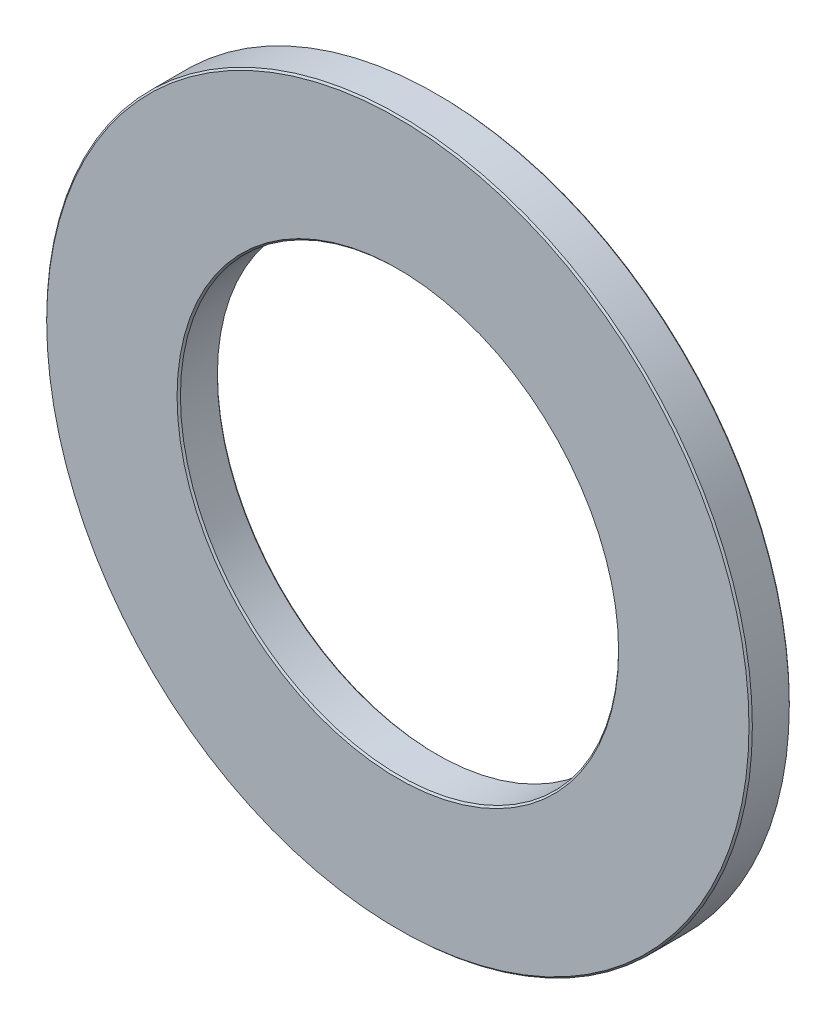
ISO-10303-21;
HEADER;
FILE_DESCRIPTION(('STEP AP214'),'2;1');
FILE_NAME('part.step','',(''),(''),'','','');
FILE_SCHEMA(('AUTOMOTIVE_DESIGN { 1 0 10303 214 1 1 1 1 }'));
ENDSEC;
DATA;
#1=APPLICATION_CONTEXT('core data for automotive mechanical design processes');
#2=APPLICATION_PROTOCOL_DEFINITION('international standard','automotive_design',2000,#1);
#3=PRODUCT_CONTEXT('',#1,'mechanical');
#4=PRODUCT('Part','Part','',(#3));
#5=PRODUCT_RELATED_PRODUCT_CATEGORY('part','',(#4));
#6=PRODUCT_DEFINITION_FORMATION('','',#4);
#7=PRODUCT_DEFINITION_CONTEXT('part definition',#1,'design');
#8=PRODUCT_DEFINITION('design','',#6,#7);
#9=PRODUCT_DEFINITION_SHAPE('','',#8);
#10=(LENGTH_UNIT() NAMED_UNIT(*) SI_UNIT(.MILLI.,.METRE.));
#11=(NAMED_UNIT(*) PLANE_ANGLE_UNIT() SI_UNIT($,.RADIAN.));
#12=(NAMED_UNIT(*) SI_UNIT($,.STERADIAN.) SOLID_ANGLE_UNIT());
#13=UNCERTAINTY_MEASURE_WITH_UNIT(LENGTH_MEASURE(1.E-05),#10,'distance_accuracy_value','');
#14=(GEOMETRIC_REPRESENTATION_CONTEXT(3) GLOBAL_UNCERTAINTY_ASSIGNED_CONTEXT((#13)) GLOBAL_UNIT_ASSIGNED_CONTEXT((#10,
#11,#12)) REPRESENTATION_CONTEXT('',''));
#15=CARTESIAN_POINT('',(0.,0.,0.));
#16=DIRECTION('',(0.,0.,1.));
#17=DIRECTION('',(1.,0.,0.));
#18=AXIS2_PLACEMENT_3D('',#15,#16,#17);
#19=CARTESIAN_POINT('',(0.,0.,6.));
#20=DIRECTION('',(0.,0.,1.));
#21=DIRECTION('',(1.,0.,0.));
#22=AXIS2_PLACEMENT_3D('',#19,#20,#21);
#23=PLANE('',#22);
#24=CARTESIAN_POINT('',(0.,0.,6.));
#25=DIRECTION('',(0.,0.,1.));
#26=DIRECTION('',(1.,0.,0.));
#27=AXIS2_PLACEMENT_3D('',#24,#25,#26);
#28=CIRCLE('',#27,32.85);
#29=CARTESIAN_POINT('',(32.85,0.,6.));
#30=VERTEX_POINT('',#29);
#31=EDGE_CURVE('E48',#30,#30,#28,.F.);
#32=ORIENTED_EDGE('',*,*,#31,.T.);
#33=EDGE_LOOP('',(#32));
#34=FACE_BOUND('',#33,.T.);
#35=CARTESIAN_POINT('',(0.,0.,6.));
#36=DIRECTION('',(0.,0.,1.));
#37=DIRECTION('',(1.,0.,0.));
#38=AXIS2_PLACEMENT_3D('',#35,#36,#37);
#39=CIRCLE('',#38,52.25);
#40=CARTESIAN_POINT('',(52.25,0.,6.));
#41=VERTEX_POINT('',#40);
#42=EDGE_CURVE('E52',#41,#41,#39,.T.);
#43=ORIENTED_EDGE('',*,*,#42,.T.);
#44=EDGE_LOOP('',(#43));
#45=FACE_BOUND('',#44,.T.);
#46=ADVANCED_FACE('F36',(#34,#45),#23,.T.);
#47=CARTESIAN_POINT('',(0.,0.,0.));
#48=DIRECTION('',(0.,0.,1.));
#49=DIRECTION('',(1.,0.,0.));
#50=AXIS2_PLACEMENT_3D('',#47,#48,#49);
#51=PLANE('',#50);
#52=CARTESIAN_POINT('',(0.,0.,0.));
#53=DIRECTION('',(0.,0.,1.));
#54=DIRECTION('',(1.,0.,0.));
#55=AXIS2_PLACEMENT_3D('',#52,#53,#54);
#56=CIRCLE('',#55,32.85);
#57=CARTESIAN_POINT('',(32.85,0.,0.));
#58=VERTEX_POINT('',#57);
#59=EDGE_CURVE('E63',#58,#58,#56,.T.);
#60=ORIENTED_EDGE('',*,*,#59,.T.);
#61=EDGE_LOOP('',(#60));
#62=FACE_BOUND('',#61,.T.);
#63=CARTESIAN_POINT('',(0.,0.,0.));
#64=DIRECTION('',(0.,0.,1.));
#65=DIRECTION('',(1.,0.,0.));
#66=AXIS2_PLACEMENT_3D('',#63,#64,#65);
#67=CIRCLE('',#66,52.25);
#68=CARTESIAN_POINT('',(52.25,0.,0.));
#69=VERTEX_POINT('',#68);
#70=EDGE_CURVE('E66',#69,#69,#67,.F.);
#71=ORIENTED_EDGE('',*,*,#70,.T.);
#72=EDGE_LOOP('',(#71));
#73=FACE_BOUND('',#72,.T.);
#74=ADVANCED_FACE('F70',(#62,#73),#51,.F.);
#75=CARTESIAN_POINT('',(0.,0.,6.));
#76=DIRECTION('',(0.,0.,-1.));
#77=DIRECTION('',(-1.,0.,0.));
#78=AXIS2_PLACEMENT_3D('',#75,#76,#77);
#79=CYLINDRICAL_SURFACE('',#78,52.5);
#80=CARTESIAN_POINT('',(0.,0.,0.249999999999993));
#81=DIRECTION('',(0.,0.,1.));
#82=DIRECTION('',(1.,0.,0.));
#83=AXIS2_PLACEMENT_3D('',#80,#81,#82);
#84=CIRCLE('',#83,52.5);
#85=CARTESIAN_POINT('',(52.5,0.,0.249999999999993));
#86=VERTEX_POINT('',#85);
#87=EDGE_CURVE('E10',#86,#86,#84,.T.);
#88=ORIENTED_EDGE('',*,*,#87,.T.);
#89=EDGE_LOOP('',(#88));
#90=FACE_BOUND('',#89,.T.);
#91=CARTESIAN_POINT('',(0.,0.,5.74999999999999));
#92=DIRECTION('',(0.,0.,1.));
#93=DIRECTION('',(1.,0.,0.));
#94=AXIS2_PLACEMENT_3D('',#91,#92,#93);
#95=CIRCLE('',#94,52.5);
#96=CARTESIAN_POINT('',(52.5,0.,5.74999999999999));
#97=VERTEX_POINT('',#96);
#98=EDGE_CURVE('E44',#97,#97,#95,.F.);
#99=ORIENTED_EDGE('',*,*,#98,.T.);
#100=EDGE_LOOP('',(#99));
#101=FACE_BOUND('',#100,.T.);
#102=ADVANCED_FACE('F91',(#90,#101),#79,.T.);
#103=CARTESIAN_POINT('',(0.,0.,6.));
#104=DIRECTION('',(0.,0.,-1.));
#105=DIRECTION('',(-1.,0.,0.));
#106=AXIS2_PLACEMENT_3D('',#103,#104,#105);
#107=CYLINDRICAL_SURFACE('',#106,32.6);
#108=CARTESIAN_POINT('',(0.,0.,0.250000000000028));
#109=DIRECTION('',(0.,0.,1.));
#110=DIRECTION('',(1.,0.,0.));
#111=AXIS2_PLACEMENT_3D('',#108,#109,#110);
#112=CIRCLE('',#111,32.6);
#113=CARTESIAN_POINT('',(32.6,0.,0.250000000000028));
#114=VERTEX_POINT('',#113);
#115=EDGE_CURVE('E57',#114,#114,#112,.F.);
#116=ORIENTED_EDGE('',*,*,#115,.T.);
#117=EDGE_LOOP('',(#116));
#118=FACE_BOUND('',#117,.T.);
#119=CARTESIAN_POINT('',(0.,0.,5.74999999999998));
#120=DIRECTION('',(0.,0.,1.));
#121=DIRECTION('',(1.,0.,0.));
#122=AXIS2_PLACEMENT_3D('',#119,#120,#121);
#123=CIRCLE('',#122,32.6);
#124=CARTESIAN_POINT('',(32.6,0.,5.74999999999998));
#125=VERTEX_POINT('',#124);
#126=EDGE_CURVE('E60',#125,#125,#123,.T.);
#127=ORIENTED_EDGE('',*,*,#126,.T.);
#128=EDGE_LOOP('',(#127));
#129=FACE_BOUND('',#128,.T.);
#130=ADVANCED_FACE('F96',(#118,#129),#107,.F.);
#131=CARTESIAN_POINT('',(0.,0.,0.));
#132=DIRECTION('',(0.,0.,-1.));
#133=DIRECTION('',(-1.,0.,0.));
#134=AXIS2_PLACEMENT_3D('',#131,#132,#133);
#135=CONICAL_SURFACE('',#134,32.85,0.785398163397448);
#136=ORIENTED_EDGE('',*,*,#115,.F.);
#137=EDGE_LOOP('',(#136));
#138=FACE_BOUND('',#137,.T.);
#139=ORIENTED_EDGE('',*,*,#59,.F.);
#140=EDGE_LOOP('',(#139));
#141=FACE_BOUND('',#140,.T.);
#142=ADVANCED_FACE('F81',(#138,#141),#135,.F.);
#143=CARTESIAN_POINT('',(0.,0.,5.74999999999998));
#144=DIRECTION('',(0.,0.,1.));
#145=DIRECTION('',(1.,0.,0.));
#146=AXIS2_PLACEMENT_3D('',#143,#144,#145);
#147=CONICAL_SURFACE('',#146,32.6,0.785398163397435);
#148=ORIENTED_EDGE('',*,*,#31,.F.);
#149=EDGE_LOOP('',(#148));
#150=FACE_BOUND('',#149,.T.);
#151=ORIENTED_EDGE('',*,*,#126,.F.);
#152=EDGE_LOOP('',(#151));
#153=FACE_BOUND('',#152,.T.);
#154=ADVANCED_FACE('F75',(#150,#153),#147,.F.);
#155=CARTESIAN_POINT('',(0.,0.,0.249999999999993));
#156=DIRECTION('',(0.,0.,1.));
#157=DIRECTION('',(1.,0.,0.));
#158=AXIS2_PLACEMENT_3D('',#155,#156,#157);
#159=CONICAL_SURFACE('',#158,52.5,0.785398163397476);
#160=ORIENTED_EDGE('',*,*,#70,.F.);
#161=EDGE_LOOP('',(#160));
#162=FACE_BOUND('',#161,.T.);
#163=ORIENTED_EDGE('',*,*,#87,.F.);
#164=EDGE_LOOP('',(#163));
#165=FACE_BOUND('',#164,.T.);
#166=ADVANCED_FACE('F72',(#162,#165),#159,.T.);
#167=CARTESIAN_POINT('',(0.,0.,6.));
#168=DIRECTION('',(0.,0.,-1.));
#169=DIRECTION('',(-1.,0.,0.));
#170=AXIS2_PLACEMENT_3D('',#167,#168,#169);
#171=CONICAL_SURFACE('',#170,52.25,0.785398163397421);
#172=ORIENTED_EDGE('',*,*,#98,.F.);
#173=EDGE_LOOP('',(#172));
#174=FACE_BOUND('',#173,.T.);
#175=ORIENTED_EDGE('',*,*,#42,.F.);
#176=EDGE_LOOP('',(#175));
#177=FACE_BOUND('',#176,.T.);
#178=ADVANCED_FACE('F39',(#174,#177),#171,.T.);
#179=CLOSED_SHELL('',(#46,#74,#102,#130,#142,#154,#166,#178));
#180=MANIFOLD_SOLID_BREP('B2',#179);
#181=ADVANCED_BREP_SHAPE_REPRESENTATION('',(#18,#180),#14);
#182=SHAPE_DEFINITION_REPRESENTATION(#9,#181);
ENDSEC;
END-ISO-10303-21;
